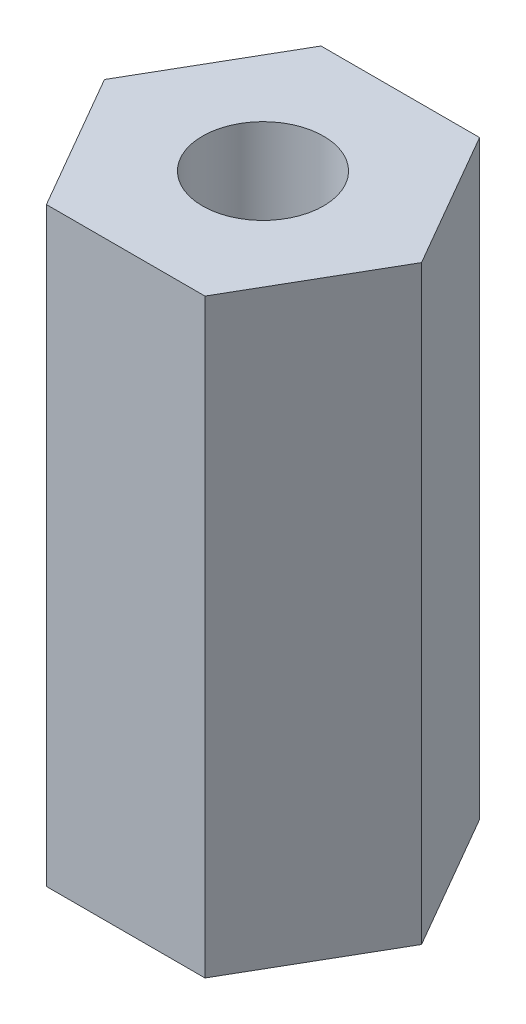
ISO-10303-21;
HEADER;
FILE_DESCRIPTION(('STEP AP214'),'2;1');
FILE_NAME('part.step','',(''),(''),'','','');
FILE_SCHEMA(('AUTOMOTIVE_DESIGN { 1 0 10303 214 1 1 1 1 }'));
ENDSEC;
DATA;
#1=APPLICATION_CONTEXT('core data for automotive mechanical design processes');
#2=APPLICATION_PROTOCOL_DEFINITION('international standard','automotive_design',2000,#1);
#3=PRODUCT_CONTEXT('',#1,'mechanical');
#4=PRODUCT('Part','Part','',(#3));
#5=PRODUCT_RELATED_PRODUCT_CATEGORY('part','',(#4));
#6=PRODUCT_DEFINITION_FORMATION('','',#4);
#7=PRODUCT_DEFINITION_CONTEXT('part definition',#1,'design');
#8=PRODUCT_DEFINITION('design','',#6,#7);
#9=PRODUCT_DEFINITION_SHAPE('','',#8);
#10=(LENGTH_UNIT() NAMED_UNIT(*) SI_UNIT(.MILLI.,.METRE.));
#11=(NAMED_UNIT(*) PLANE_ANGLE_UNIT() SI_UNIT($,.RADIAN.));
#12=(NAMED_UNIT(*) SI_UNIT($,.STERADIAN.) SOLID_ANGLE_UNIT());
#13=UNCERTAINTY_MEASURE_WITH_UNIT(LENGTH_MEASURE(1.E-05),#10,'distance_accuracy_value','');
#14=(GEOMETRIC_REPRESENTATION_CONTEXT(3) GLOBAL_UNCERTAINTY_ASSIGNED_CONTEXT((#13)) GLOBAL_UNIT_ASSIGNED_CONTEXT((#10,
#11,#12)) REPRESENTATION_CONTEXT('',''));
#15=CARTESIAN_POINT('',(0.,0.,0.));
#16=DIRECTION('',(0.,0.,1.));
#17=DIRECTION('',(1.,0.,0.));
#18=AXIS2_PLACEMENT_3D('',#15,#16,#17);
#19=CARTESIAN_POINT('',(1.34233937586591,10.,2.32499999999999));
#20=DIRECTION('',(-0.866025403784442,0.,-0.499999999999995));
#21=DIRECTION('',(-0.499999999999995,0.,0.866025403784442));
#22=AXIS2_PLACEMENT_3D('',#19,#20,#21);
#23=PLANE('',#22);
#24=DIRECTION('',(0.499999999999995,0.,-0.866025403784442));
#25=VECTOR('',#24,1.);
#26=CARTESIAN_POINT('',(1.34233937586591,0.,2.32499999999999));
#27=LINE('',#26,#25);
#28=CARTESIAN_POINT('',(1.34233937586591,0.,2.32499999999999));
#29=VERTEX_POINT('',#28);
#30=CARTESIAN_POINT('',(2.68467875173176,0.,0.));
#31=VERTEX_POINT('',#30);
#32=EDGE_CURVE('E131',#29,#31,#27,.T.);
#33=ORIENTED_EDGE('',*,*,#32,.T.);
#34=DIRECTION('',(0.,-1.,0.));
#35=VECTOR('',#34,1.);
#36=CARTESIAN_POINT('',(2.68467875173176,10.,0.));
#37=LINE('',#36,#35);
#38=CARTESIAN_POINT('',(2.68467875173176,10.,0.));
#39=VERTEX_POINT('',#38);
#40=EDGE_CURVE('E11',#39,#31,#37,.T.);
#41=ORIENTED_EDGE('',*,*,#40,.F.);
#42=DIRECTION('',(0.499999999999995,0.,-0.866025403784442));
#43=VECTOR('',#42,1.);
#44=CARTESIAN_POINT('',(1.34233937586591,10.,2.32499999999999));
#45=LINE('',#44,#43);
#46=CARTESIAN_POINT('',(1.34233937586591,10.,2.32499999999999));
#47=VERTEX_POINT('',#46);
#48=EDGE_CURVE('E148',#47,#39,#45,.T.);
#49=ORIENTED_EDGE('',*,*,#48,.F.);
#50=DIRECTION('',(0.,-1.,0.));
#51=VECTOR('',#50,1.);
#52=CARTESIAN_POINT('',(1.34233937586591,10.,2.32499999999999));
#53=LINE('',#52,#51);
#54=EDGE_CURVE('E127',#47,#29,#53,.T.);
#55=ORIENTED_EDGE('',*,*,#54,.T.);
#56=EDGE_LOOP('',(#33,#41,#49,#55));
#57=FACE_BOUND('',#56,.T.);
#58=ADVANCED_FACE('F42',(#57),#23,.F.);
#59=CARTESIAN_POINT('',(2.68467875173176,10.,0.));
#60=DIRECTION('',(-0.866025403784438,0.,0.500000000000001));
#61=DIRECTION('',(0.500000000000001,0.,0.866025403784438));
#62=AXIS2_PLACEMENT_3D('',#59,#60,#61);
#63=PLANE('',#62);
#64=DIRECTION('',(-0.500000000000001,0.,-0.866025403784438));
#65=VECTOR('',#64,1.);
#66=CARTESIAN_POINT('',(2.68467875173176,0.,0.));
#67=LINE('',#66,#65);
#68=CARTESIAN_POINT('',(1.34233937586588,0.,-2.32500000000001));
#69=VERTEX_POINT('',#68);
#70=EDGE_CURVE('E135',#31,#69,#67,.T.);
#71=ORIENTED_EDGE('',*,*,#70,.T.);
#72=DIRECTION('',(0.,-1.,0.));
#73=VECTOR('',#72,1.);
#74=CARTESIAN_POINT('',(1.34233937586588,10.,-2.32500000000001));
#75=LINE('',#74,#73);
#76=CARTESIAN_POINT('',(1.34233937586588,10.,-2.32500000000001));
#77=VERTEX_POINT('',#76);
#78=EDGE_CURVE('E51',#77,#69,#75,.T.);
#79=ORIENTED_EDGE('',*,*,#78,.F.);
#80=DIRECTION('',(-0.500000000000001,0.,-0.866025403784438));
#81=VECTOR('',#80,1.);
#82=CARTESIAN_POINT('',(2.68467875173176,10.,0.));
#83=LINE('',#82,#81);
#84=EDGE_CURVE('E96',#39,#77,#83,.T.);
#85=ORIENTED_EDGE('',*,*,#84,.F.);
#86=ORIENTED_EDGE('',*,*,#40,.T.);
#87=EDGE_LOOP('',(#71,#79,#85,#86));
#88=FACE_BOUND('',#87,.T.);
#89=ADVANCED_FACE('F178',(#88),#63,.F.);
#90=CARTESIAN_POINT('',(1.34233937586588,10.,-2.32500000000001));
#91=DIRECTION('',(0.,0.,1.));
#92=DIRECTION('',(1.,0.,0.));
#93=AXIS2_PLACEMENT_3D('',#90,#91,#92);
#94=PLANE('',#93);
#95=DIRECTION('',(-1.,0.,0.));
#96=VECTOR('',#95,1.);
#97=CARTESIAN_POINT('',(1.34233937586588,0.,-2.32500000000001));
#98=LINE('',#97,#96);
#99=CARTESIAN_POINT('',(-1.34233937586589,0.,-2.325));
#100=VERTEX_POINT('',#99);
#101=EDGE_CURVE('E139',#69,#100,#98,.T.);
#102=ORIENTED_EDGE('',*,*,#101,.T.);
#103=DIRECTION('',(0.,-1.,0.));
#104=VECTOR('',#103,1.);
#105=CARTESIAN_POINT('',(-1.34233937586589,10.,-2.325));
#106=LINE('',#105,#104);
#107=CARTESIAN_POINT('',(-1.34233937586589,10.,-2.325));
#108=VERTEX_POINT('',#107);
#109=EDGE_CURVE('E120',#108,#100,#106,.T.);
#110=ORIENTED_EDGE('',*,*,#109,.F.);
#111=DIRECTION('',(-1.,0.,0.));
#112=VECTOR('',#111,1.);
#113=CARTESIAN_POINT('',(1.34233937586588,10.,-2.32500000000001));
#114=LINE('',#113,#112);
#115=EDGE_CURVE('E109',#77,#108,#114,.T.);
#116=ORIENTED_EDGE('',*,*,#115,.F.);
#117=ORIENTED_EDGE('',*,*,#78,.T.);
#118=EDGE_LOOP('',(#102,#110,#116,#117));
#119=FACE_BOUND('',#118,.T.);
#120=ADVANCED_FACE('F158',(#119),#94,.F.);
#121=CARTESIAN_POINT('',(-1.34233937586589,10.,-2.325));
#122=DIRECTION('',(0.866025403784442,0.,0.499999999999995));
#123=DIRECTION('',(0.499999999999995,0.,-0.866025403784442));
#124=AXIS2_PLACEMENT_3D('',#121,#122,#123);
#125=PLANE('',#124);
#126=DIRECTION('',(-0.499999999999995,0.,0.866025403784442));
#127=VECTOR('',#126,1.);
#128=CARTESIAN_POINT('',(-1.34233937586589,0.,-2.325));
#129=LINE('',#128,#127);
#130=CARTESIAN_POINT('',(-2.68467875173176,0.,0.));
#131=VERTEX_POINT('',#130);
#132=EDGE_CURVE('E118',#100,#131,#129,.T.);
#133=ORIENTED_EDGE('',*,*,#132,.T.);
#134=DIRECTION('',(0.,-1.,0.));
#135=VECTOR('',#134,1.);
#136=CARTESIAN_POINT('',(-2.68467875173176,10.,0.));
#137=LINE('',#136,#135);
#138=CARTESIAN_POINT('',(-2.68467875173176,10.,0.));
#139=VERTEX_POINT('',#138);
#140=EDGE_CURVE('E115',#139,#131,#137,.T.);
#141=ORIENTED_EDGE('',*,*,#140,.F.);
#142=DIRECTION('',(-0.499999999999995,0.,0.866025403784442));
#143=VECTOR('',#142,1.);
#144=CARTESIAN_POINT('',(-1.34233937586589,10.,-2.325));
#145=LINE('',#144,#143);
#146=EDGE_CURVE('E103',#108,#139,#145,.T.);
#147=ORIENTED_EDGE('',*,*,#146,.F.);
#148=ORIENTED_EDGE('',*,*,#109,.T.);
#149=EDGE_LOOP('',(#133,#141,#147,#148));
#150=FACE_BOUND('',#149,.T.);
#151=ADVANCED_FACE('F116',(#150),#125,.F.);
#152=CARTESIAN_POINT('',(-2.68467875173176,10.,0.));
#153=DIRECTION('',(0.866025403784435,0.,-0.500000000000007));
#154=DIRECTION('',(-0.500000000000007,0.,-0.866025403784435));
#155=AXIS2_PLACEMENT_3D('',#152,#153,#154);
#156=PLANE('',#155);
#157=DIRECTION('',(0.500000000000007,0.,0.866025403784435));
#158=VECTOR('',#157,1.);
#159=CARTESIAN_POINT('',(-2.68467875173176,0.,0.));
#160=LINE('',#159,#158);
#161=CARTESIAN_POINT('',(-1.34233937586586,0.,2.32500000000001));
#162=VERTEX_POINT('',#161);
#163=EDGE_CURVE('E82',#131,#162,#160,.T.);
#164=ORIENTED_EDGE('',*,*,#163,.T.);
#165=DIRECTION('',(0.,-1.,0.));
#166=VECTOR('',#165,1.);
#167=CARTESIAN_POINT('',(-1.34233937586586,10.,2.32500000000001));
#168=LINE('',#167,#166);
#169=CARTESIAN_POINT('',(-1.34233937586586,10.,2.32500000000001));
#170=VERTEX_POINT('',#169);
#171=EDGE_CURVE('E121',#170,#162,#168,.T.);
#172=ORIENTED_EDGE('',*,*,#171,.F.);
#173=DIRECTION('',(0.500000000000007,0.,0.866025403784435));
#174=VECTOR('',#173,1.);
#175=CARTESIAN_POINT('',(-2.68467875173176,10.,0.));
#176=LINE('',#175,#174);
#177=EDGE_CURVE('E107',#139,#170,#176,.T.);
#178=ORIENTED_EDGE('',*,*,#177,.F.);
#179=ORIENTED_EDGE('',*,*,#140,.T.);
#180=EDGE_LOOP('',(#164,#172,#178,#179));
#181=FACE_BOUND('',#180,.T.);
#182=ADVANCED_FACE('F123',(#181),#156,.F.);
#183=CARTESIAN_POINT('',(-1.34233937586586,10.,2.32500000000001));
#184=DIRECTION('',(0.,0.,-1.));
#185=DIRECTION('',(-1.,0.,0.));
#186=AXIS2_PLACEMENT_3D('',#183,#184,#185);
#187=PLANE('',#186);
#188=DIRECTION('',(1.,0.,0.));
#189=VECTOR('',#188,1.);
#190=CARTESIAN_POINT('',(-1.34233937586586,0.,2.32500000000001));
#191=LINE('',#190,#189);
#192=EDGE_CURVE('E88',#162,#29,#191,.T.);
#193=ORIENTED_EDGE('',*,*,#192,.T.);
#194=ORIENTED_EDGE('',*,*,#54,.F.);
#195=DIRECTION('',(1.,0.,0.));
#196=VECTOR('',#195,1.);
#197=CARTESIAN_POINT('',(-1.34233937586586,10.,2.32500000000001));
#198=LINE('',#197,#196);
#199=EDGE_CURVE('E59',#170,#47,#198,.T.);
#200=ORIENTED_EDGE('',*,*,#199,.F.);
#201=ORIENTED_EDGE('',*,*,#171,.T.);
#202=EDGE_LOOP('',(#193,#194,#200,#201));
#203=FACE_BOUND('',#202,.T.);
#204=ADVANCED_FACE('F165',(#203),#187,.F.);
#205=CARTESIAN_POINT('',(0.,10.,0.));
#206=DIRECTION('',(0.,1.,0.));
#207=DIRECTION('',(0.,0.,1.));
#208=AXIS2_PLACEMENT_3D('',#205,#206,#207);
#209=PLANE('',#208);
#210=CARTESIAN_POINT('',(0.,10.,0.));
#211=DIRECTION('',(0.,1.,0.));
#212=DIRECTION('',(0.,0.,1.));
#213=AXIS2_PLACEMENT_3D('',#210,#211,#212);
#214=CIRCLE('',#213,1.025);
#215=CARTESIAN_POINT('',(0.,10.,1.025));
#216=VERTEX_POINT('',#215);
#217=EDGE_CURVE('E234',#216,#216,#214,.T.);
#218=ORIENTED_EDGE('',*,*,#217,.F.);
#219=EDGE_LOOP('',(#218));
#220=FACE_BOUND('',#219,.T.);
#221=ORIENTED_EDGE('',*,*,#48,.T.);
#222=ORIENTED_EDGE('',*,*,#84,.T.);
#223=ORIENTED_EDGE('',*,*,#115,.T.);
#224=ORIENTED_EDGE('',*,*,#146,.T.);
#225=ORIENTED_EDGE('',*,*,#177,.T.);
#226=ORIENTED_EDGE('',*,*,#199,.T.);
#227=EDGE_LOOP('',(#221,#222,#223,#224,#225,#226));
#228=FACE_BOUND('',#227,.T.);
#229=ADVANCED_FACE('F105',(#220,#228),#209,.T.);
#230=CARTESIAN_POINT('',(0.,0.,0.));
#231=DIRECTION('',(0.,1.,0.));
#232=DIRECTION('',(0.,0.,1.));
#233=AXIS2_PLACEMENT_3D('',#230,#231,#232);
#234=PLANE('',#233);
#235=CARTESIAN_POINT('',(0.,0.,0.));
#236=DIRECTION('',(0.,1.,0.));
#237=DIRECTION('',(0.,0.,1.));
#238=AXIS2_PLACEMENT_3D('',#235,#236,#237);
#239=CIRCLE('',#238,1.025);
#240=CARTESIAN_POINT('',(0.,0.,1.025));
#241=VERTEX_POINT('',#240);
#242=EDGE_CURVE('E136',#241,#241,#239,.T.);
#243=ORIENTED_EDGE('',*,*,#242,.T.);
#244=EDGE_LOOP('',(#243));
#245=FACE_BOUND('',#244,.T.);
#246=ORIENTED_EDGE('',*,*,#32,.F.);
#247=ORIENTED_EDGE('',*,*,#192,.F.);
#248=ORIENTED_EDGE('',*,*,#163,.F.);
#249=ORIENTED_EDGE('',*,*,#132,.F.);
#250=ORIENTED_EDGE('',*,*,#101,.F.);
#251=ORIENTED_EDGE('',*,*,#70,.F.);
#252=EDGE_LOOP('',(#246,#247,#248,#249,#250,#251));
#253=FACE_BOUND('',#252,.T.);
#254=ADVANCED_FACE('F161',(#245,#253),#234,.F.);
#255=CARTESIAN_POINT('',(0.,10.,0.));
#256=DIRECTION('',(0.,1.,0.));
#257=DIRECTION('',(0.,0.,1.));
#258=AXIS2_PLACEMENT_3D('',#255,#256,#257);
#259=CYLINDRICAL_SURFACE('',#258,1.025);
#260=ORIENTED_EDGE('',*,*,#217,.T.);
#261=EDGE_LOOP('',(#260));
#262=FACE_BOUND('',#261,.T.);
#263=ORIENTED_EDGE('',*,*,#242,.F.);
#264=EDGE_LOOP('',(#263));
#265=FACE_BOUND('',#264,.T.);
#266=ADVANCED_FACE('F211',(#262,#265),#259,.F.);
#267=CLOSED_SHELL('',(#58,#89,#120,#151,#182,#204,#229,#254,#266));
#268=MANIFOLD_SOLID_BREP('B2',#267);
#269=ADVANCED_BREP_SHAPE_REPRESENTATION('',(#18,#268),#14);
#270=SHAPE_DEFINITION_REPRESENTATION(#9,#269);
ENDSEC;
END-ISO-10303-21;
